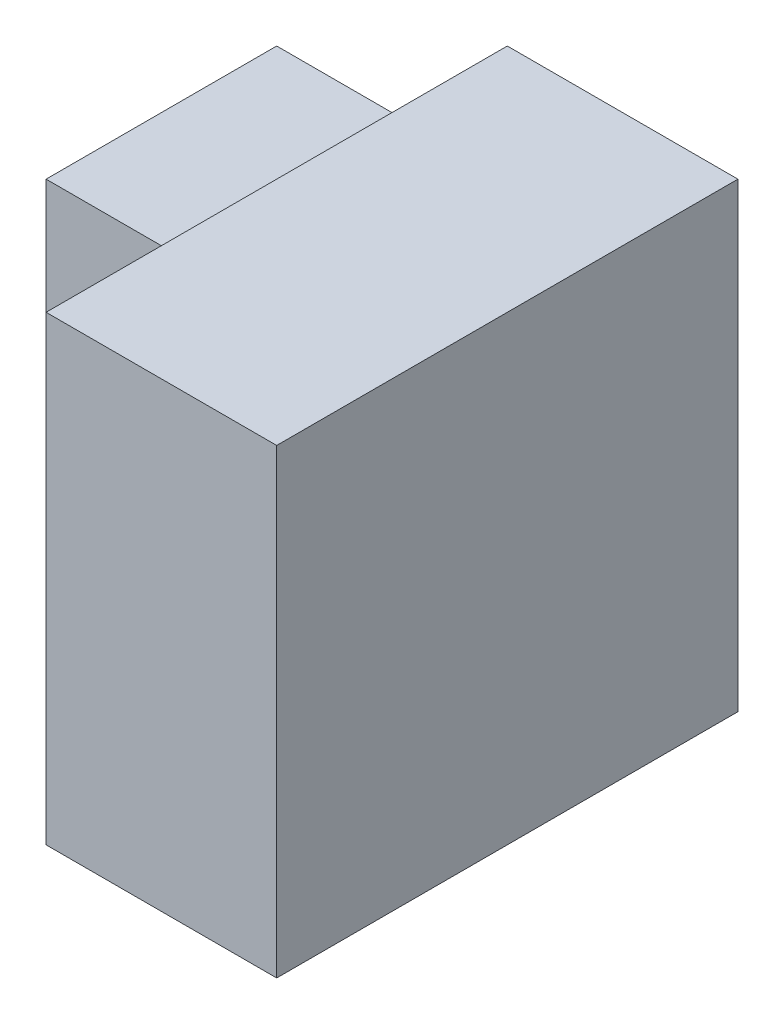
ISO-10303-21;
HEADER;
FILE_DESCRIPTION(('STEP AP214'),'2;1');
FILE_NAME('part.step','',(''),(''),'','','');
FILE_SCHEMA(('AUTOMOTIVE_DESIGN { 1 0 10303 214 1 1 1 1 }'));
ENDSEC;
DATA;
#1=APPLICATION_CONTEXT('core data for automotive mechanical design processes');
#2=APPLICATION_PROTOCOL_DEFINITION('international standard','automotive_design',2000,#1);
#3=PRODUCT_CONTEXT('',#1,'mechanical');
#4=PRODUCT('Part','Part','',(#3));
#5=PRODUCT_RELATED_PRODUCT_CATEGORY('part','',(#4));
#6=PRODUCT_DEFINITION_FORMATION('','',#4);
#7=PRODUCT_DEFINITION_CONTEXT('part definition',#1,'design');
#8=PRODUCT_DEFINITION('design','',#6,#7);
#9=PRODUCT_DEFINITION_SHAPE('','',#8);
#10=(LENGTH_UNIT() NAMED_UNIT(*) SI_UNIT(.MILLI.,.METRE.));
#11=(NAMED_UNIT(*) PLANE_ANGLE_UNIT() SI_UNIT($,.RADIAN.));
#12=(NAMED_UNIT(*) SI_UNIT($,.STERADIAN.) SOLID_ANGLE_UNIT());
#13=UNCERTAINTY_MEASURE_WITH_UNIT(LENGTH_MEASURE(1.E-05),#10,'distance_accuracy_value','');
#14=(GEOMETRIC_REPRESENTATION_CONTEXT(3) GLOBAL_UNCERTAINTY_ASSIGNED_CONTEXT((#13)) GLOBAL_UNIT_ASSIGNED_CONTEXT((#10,
#11,#12)) REPRESENTATION_CONTEXT('',''));
#15=CARTESIAN_POINT('',(0.,0.,0.));
#16=DIRECTION('',(0.,0.,1.));
#17=DIRECTION('',(1.,0.,0.));
#18=AXIS2_PLACEMENT_3D('',#15,#16,#17);
#19=CARTESIAN_POINT('',(2.,0.,0.));
#20=DIRECTION('',(0.,1.,0.));
#21=DIRECTION('',(0.,0.,1.));
#22=AXIS2_PLACEMENT_3D('',#19,#20,#21);
#23=PLANE('',#22);
#24=DIRECTION('',(0.,0.,1.));
#25=VECTOR('',#24,1.);
#26=CARTESIAN_POINT('',(0.,0.,0.));
#27=LINE('',#26,#25);
#28=CARTESIAN_POINT('',(0.,0.,-4.));
#29=VERTEX_POINT('',#28);
#30=CARTESIAN_POINT('',(0.,0.,-2.));
#31=VERTEX_POINT('',#30);
#32=EDGE_CURVE('E113',#29,#31,#27,.T.);
#33=ORIENTED_EDGE('',*,*,#32,.F.);
#34=DIRECTION('',(-1.,0.,0.));
#35=VECTOR('',#34,1.);
#36=CARTESIAN_POINT('',(2.,0.,-4.));
#37=LINE('',#36,#35);
#38=CARTESIAN_POINT('',(2.,0.,-4.));
#39=VERTEX_POINT('',#38);
#40=EDGE_CURVE('E43',#39,#29,#37,.T.);
#41=ORIENTED_EDGE('',*,*,#40,.F.);
#42=DIRECTION('',(0.,0.,-1.));
#43=VECTOR('',#42,1.);
#44=CARTESIAN_POINT('',(2.,0.,0.));
#45=LINE('',#44,#43);
#46=CARTESIAN_POINT('',(2.,0.,0.));
#47=VERTEX_POINT('',#46);
#48=EDGE_CURVE('E80',#47,#39,#45,.T.);
#49=ORIENTED_EDGE('',*,*,#48,.F.);
#50=DIRECTION('',(-1.,0.,0.));
#51=VECTOR('',#50,1.);
#52=CARTESIAN_POINT('',(2.,0.,0.));
#53=LINE('',#52,#51);
#54=CARTESIAN_POINT('',(0.,0.,0.));
#55=VERTEX_POINT('',#54);
#56=EDGE_CURVE('E11',#47,#55,#53,.T.);
#57=ORIENTED_EDGE('',*,*,#56,.T.);
#58=DIRECTION('',(0.,0.,-1.));
#59=VECTOR('',#58,1.);
#60=CARTESIAN_POINT('',(0.,0.,0.));
#61=LINE('',#60,#59);
#62=EDGE_CURVE('E126',#55,#31,#61,.T.);
#63=ORIENTED_EDGE('',*,*,#62,.T.);
#64=EDGE_LOOP('',(#33,#41,#49,#57,#63));
#65=FACE_BOUND('',#64,.T.);
#66=ADVANCED_FACE('F33',(#65),#23,.F.);
#67=CARTESIAN_POINT('',(2.,0.,-4.));
#68=DIRECTION('',(0.,0.,1.));
#69=DIRECTION('',(1.,0.,0.));
#70=AXIS2_PLACEMENT_3D('',#67,#68,#69);
#71=PLANE('',#70);
#72=DIRECTION('',(0.,-1.,0.));
#73=VECTOR('',#72,1.);
#74=CARTESIAN_POINT('',(0.,0.,-4.));
#75=LINE('',#74,#73);
#76=CARTESIAN_POINT('',(0.,3.,-4.));
#77=VERTEX_POINT('',#76);
#78=EDGE_CURVE('E112',#77,#29,#75,.T.);
#79=ORIENTED_EDGE('',*,*,#78,.F.);
#80=DIRECTION('',(0.,1.,0.));
#81=VECTOR('',#80,1.);
#82=CARTESIAN_POINT('',(0.,0.,-4.));
#83=LINE('',#82,#81);
#84=CARTESIAN_POINT('',(0.,4.,-4.));
#85=VERTEX_POINT('',#84);
#86=EDGE_CURVE('E67',#77,#85,#83,.T.);
#87=ORIENTED_EDGE('',*,*,#86,.T.);
#88=DIRECTION('',(-1.,0.,0.));
#89=VECTOR('',#88,1.);
#90=CARTESIAN_POINT('',(2.,4.,-4.));
#91=LINE('',#90,#89);
#92=CARTESIAN_POINT('',(2.,4.,-4.));
#93=VERTEX_POINT('',#92);
#94=EDGE_CURVE('E171',#93,#85,#91,.T.);
#95=ORIENTED_EDGE('',*,*,#94,.F.);
#96=DIRECTION('',(0.,1.,0.));
#97=VECTOR('',#96,1.);
#98=CARTESIAN_POINT('',(2.,0.,-4.));
#99=LINE('',#98,#97);
#100=EDGE_CURVE('E160',#39,#93,#99,.T.);
#101=ORIENTED_EDGE('',*,*,#100,.F.);
#102=ORIENTED_EDGE('',*,*,#40,.T.);
#103=EDGE_LOOP('',(#79,#87,#95,#101,#102));
#104=FACE_BOUND('',#103,.T.);
#105=ADVANCED_FACE('F192',(#104),#71,.F.);
#106=CARTESIAN_POINT('',(2.,0.,0.));
#107=DIRECTION('',(0.,0.,-1.));
#108=DIRECTION('',(-1.,0.,0.));
#109=AXIS2_PLACEMENT_3D('',#106,#107,#108);
#110=PLANE('',#109);
#111=DIRECTION('',(0.,-1.,0.));
#112=VECTOR('',#111,1.);
#113=CARTESIAN_POINT('',(0.,0.,0.));
#114=LINE('',#113,#112);
#115=CARTESIAN_POINT('',(0.,4.,0.));
#116=VERTEX_POINT('',#115);
#117=EDGE_CURVE('E135',#116,#55,#114,.T.);
#118=ORIENTED_EDGE('',*,*,#117,.T.);
#119=ORIENTED_EDGE('',*,*,#56,.F.);
#120=DIRECTION('',(0.,-1.,0.));
#121=VECTOR('',#120,1.);
#122=CARTESIAN_POINT('',(2.,0.,0.));
#123=LINE('',#122,#121);
#124=CARTESIAN_POINT('',(2.,4.,0.));
#125=VERTEX_POINT('',#124);
#126=EDGE_CURVE('E157',#125,#47,#123,.T.);
#127=ORIENTED_EDGE('',*,*,#126,.F.);
#128=DIRECTION('',(-1.,0.,0.));
#129=VECTOR('',#128,1.);
#130=CARTESIAN_POINT('',(2.,4.,0.));
#131=LINE('',#130,#129);
#132=EDGE_CURVE('E162',#125,#116,#131,.T.);
#133=ORIENTED_EDGE('',*,*,#132,.T.);
#134=EDGE_LOOP('',(#118,#119,#127,#133));
#135=FACE_BOUND('',#134,.T.);
#136=ADVANCED_FACE('F35',(#135),#110,.F.);
#137=CARTESIAN_POINT('',(2.,4.,0.));
#138=DIRECTION('',(0.,-1.,0.));
#139=DIRECTION('',(0.,0.,-1.));
#140=AXIS2_PLACEMENT_3D('',#137,#138,#139);
#141=PLANE('',#140);
#142=DIRECTION('',(0.,0.,1.));
#143=VECTOR('',#142,1.);
#144=CARTESIAN_POINT('',(0.,4.,0.));
#145=LINE('',#144,#143);
#146=EDGE_CURVE('E73',#85,#116,#145,.T.);
#147=ORIENTED_EDGE('',*,*,#146,.T.);
#148=ORIENTED_EDGE('',*,*,#132,.F.);
#149=DIRECTION('',(0.,0.,1.));
#150=VECTOR('',#149,1.);
#151=CARTESIAN_POINT('',(2.,4.,0.));
#152=LINE('',#151,#150);
#153=EDGE_CURVE('E52',#93,#125,#152,.T.);
#154=ORIENTED_EDGE('',*,*,#153,.F.);
#155=ORIENTED_EDGE('',*,*,#94,.T.);
#156=EDGE_LOOP('',(#147,#148,#154,#155));
#157=FACE_BOUND('',#156,.T.);
#158=ADVANCED_FACE('F199',(#157),#141,.F.);
#159=CARTESIAN_POINT('',(2.,0.,0.));
#160=DIRECTION('',(-1.,0.,0.));
#161=DIRECTION('',(0.,0.,1.));
#162=AXIS2_PLACEMENT_3D('',#159,#160,#161);
#163=PLANE('',#162);
#164=ORIENTED_EDGE('',*,*,#126,.T.);
#165=ORIENTED_EDGE('',*,*,#48,.T.);
#166=ORIENTED_EDGE('',*,*,#100,.T.);
#167=ORIENTED_EDGE('',*,*,#153,.T.);
#168=EDGE_LOOP('',(#164,#165,#166,#167));
#169=FACE_BOUND('',#168,.T.);
#170=ADVANCED_FACE('F202',(#169),#163,.F.);
#171=CARTESIAN_POINT('',(0.,0.,0.));
#172=DIRECTION('',(-1.,0.,0.));
#173=DIRECTION('',(0.,0.,1.));
#174=AXIS2_PLACEMENT_3D('',#171,#172,#173);
#175=PLANE('',#174);
#176=DIRECTION('',(0.,0.,-1.));
#177=VECTOR('',#176,1.);
#178=CARTESIAN_POINT('',(0.,3.,-4.));
#179=LINE('',#178,#177);
#180=CARTESIAN_POINT('',(0.,3.,-2.));
#181=VERTEX_POINT('',#180);
#182=EDGE_CURVE('E128',#181,#77,#179,.T.);
#183=ORIENTED_EDGE('',*,*,#182,.F.);
#184=DIRECTION('',(0.,1.,0.));
#185=VECTOR('',#184,1.);
#186=CARTESIAN_POINT('',(0.,0.,-2.));
#187=LINE('',#186,#185);
#188=EDGE_CURVE('E123',#31,#181,#187,.T.);
#189=ORIENTED_EDGE('',*,*,#188,.F.);
#190=ORIENTED_EDGE('',*,*,#62,.F.);
#191=ORIENTED_EDGE('',*,*,#117,.F.);
#192=ORIENTED_EDGE('',*,*,#146,.F.);
#193=ORIENTED_EDGE('',*,*,#86,.F.);
#194=EDGE_LOOP('',(#183,#189,#190,#191,#192,#193));
#195=FACE_BOUND('',#194,.T.);
#196=ADVANCED_FACE('F124',(#195),#175,.T.);
#197=CARTESIAN_POINT('',(-2.,0.,-2.));
#198=DIRECTION('',(0.,0.,-1.));
#199=DIRECTION('',(-1.,0.,0.));
#200=AXIS2_PLACEMENT_3D('',#197,#198,#199);
#201=PLANE('',#200);
#202=ORIENTED_EDGE('',*,*,#188,.T.);
#203=DIRECTION('',(1.,0.,0.));
#204=VECTOR('',#203,1.);
#205=CARTESIAN_POINT('',(-2.,3.,-2.));
#206=LINE('',#205,#204);
#207=CARTESIAN_POINT('',(-2.,3.,-2.));
#208=VERTEX_POINT('',#207);
#209=EDGE_CURVE('E140',#208,#181,#206,.T.);
#210=ORIENTED_EDGE('',*,*,#209,.F.);
#211=DIRECTION('',(0.,1.,0.));
#212=VECTOR('',#211,1.);
#213=CARTESIAN_POINT('',(-2.,0.,-2.));
#214=LINE('',#213,#212);
#215=CARTESIAN_POINT('',(-2.,0.,-2.));
#216=VERTEX_POINT('',#215);
#217=EDGE_CURVE('E139',#216,#208,#214,.T.);
#218=ORIENTED_EDGE('',*,*,#217,.F.);
#219=DIRECTION('',(1.,0.,0.));
#220=VECTOR('',#219,1.);
#221=CARTESIAN_POINT('',(-2.,0.,-2.));
#222=LINE('',#221,#220);
#223=EDGE_CURVE('E107',#216,#31,#222,.T.);
#224=ORIENTED_EDGE('',*,*,#223,.T.);
#225=EDGE_LOOP('',(#202,#210,#218,#224));
#226=FACE_BOUND('',#225,.T.);
#227=ADVANCED_FACE('F138',(#226),#201,.F.);
#228=CARTESIAN_POINT('',(-2.,3.,-4.));
#229=DIRECTION('',(0.,-1.,0.));
#230=DIRECTION('',(0.,0.,-1.));
#231=AXIS2_PLACEMENT_3D('',#228,#229,#230);
#232=PLANE('',#231);
#233=ORIENTED_EDGE('',*,*,#182,.T.);
#234=DIRECTION('',(1.,0.,0.));
#235=VECTOR('',#234,1.);
#236=CARTESIAN_POINT('',(-2.,3.,-4.));
#237=LINE('',#236,#235);
#238=CARTESIAN_POINT('',(-2.,3.,-4.));
#239=VERTEX_POINT('',#238);
#240=EDGE_CURVE('E110',#239,#77,#237,.T.);
#241=ORIENTED_EDGE('',*,*,#240,.F.);
#242=DIRECTION('',(0.,0.,-1.));
#243=VECTOR('',#242,1.);
#244=CARTESIAN_POINT('',(-2.,3.,-4.));
#245=LINE('',#244,#243);
#246=EDGE_CURVE('E154',#208,#239,#245,.T.);
#247=ORIENTED_EDGE('',*,*,#246,.F.);
#248=ORIENTED_EDGE('',*,*,#209,.T.);
#249=EDGE_LOOP('',(#233,#241,#247,#248));
#250=FACE_BOUND('',#249,.T.);
#251=ADVANCED_FACE('F176',(#250),#232,.F.);
#252=CARTESIAN_POINT('',(-2.,0.,0.));
#253=DIRECTION('',(1.,0.,0.));
#254=DIRECTION('',(0.,0.,-1.));
#255=AXIS2_PLACEMENT_3D('',#252,#253,#254);
#256=PLANE('',#255);
#257=ORIENTED_EDGE('',*,*,#246,.T.);
#258=DIRECTION('',(0.,0.832050294337844,-0.554700196225229));
#259=VECTOR('',#258,1.);
#260=CARTESIAN_POINT('',(-2.,-0.923076923076923,-1.38461538461538));
#261=LINE('',#260,#259);
#262=EDGE_CURVE('E120',#216,#239,#261,.T.);
#263=ORIENTED_EDGE('',*,*,#262,.F.);
#264=ORIENTED_EDGE('',*,*,#217,.T.);
#265=EDGE_LOOP('',(#257,#263,#264));
#266=FACE_BOUND('',#265,.T.);
#267=ADVANCED_FACE('F181',(#266),#256,.F.);
#268=CARTESIAN_POINT('',(0.,-0.923076923076923,-1.38461538461538));
#269=DIRECTION('',(0.,0.554700196225229,0.832050294337844));
#270=DIRECTION('',(0.,-0.832050294337844,0.554700196225229));
#271=AXIS2_PLACEMENT_3D('',#268,#269,#270);
#272=PLANE('',#271);
#273=ORIENTED_EDGE('',*,*,#262,.T.);
#274=ORIENTED_EDGE('',*,*,#240,.T.);
#275=DIRECTION('',(0.,0.832050294337844,-0.554700196225229));
#276=VECTOR('',#275,1.);
#277=CARTESIAN_POINT('',(0.,-0.923076923076923,-1.38461538461538));
#278=LINE('',#277,#276);
#279=EDGE_CURVE('E103',#31,#77,#278,.T.);
#280=ORIENTED_EDGE('',*,*,#279,.F.);
#281=ORIENTED_EDGE('',*,*,#223,.F.);
#282=EDGE_LOOP('',(#273,#274,#280,#281));
#283=FACE_BOUND('',#282,.T.);
#284=ADVANCED_FACE('F105',(#283),#272,.F.);
#285=CARTESIAN_POINT('',(0.,0.,0.));
#286=DIRECTION('',(-1.,0.,0.));
#287=DIRECTION('',(0.,0.,1.));
#288=AXIS2_PLACEMENT_3D('',#285,#286,#287);
#289=PLANE('',#288);
#290=ORIENTED_EDGE('',*,*,#32,.T.);
#291=ORIENTED_EDGE('',*,*,#279,.T.);
#292=ORIENTED_EDGE('',*,*,#78,.T.);
#293=EDGE_LOOP('',(#290,#291,#292));
#294=FACE_BOUND('',#293,.T.);
#295=ADVANCED_FACE('F117',(#294),#289,.T.);
#296=CLOSED_SHELL('',(#66,#105,#136,#158,#170,#196,#227,#251,#267,#284,#295));
#297=MANIFOLD_SOLID_BREP('B2',#296);
#298=ADVANCED_BREP_SHAPE_REPRESENTATION('',(#18,#297),#14);
#299=SHAPE_DEFINITION_REPRESENTATION(#9,#298);
ENDSEC;
END-ISO-10303-21;
